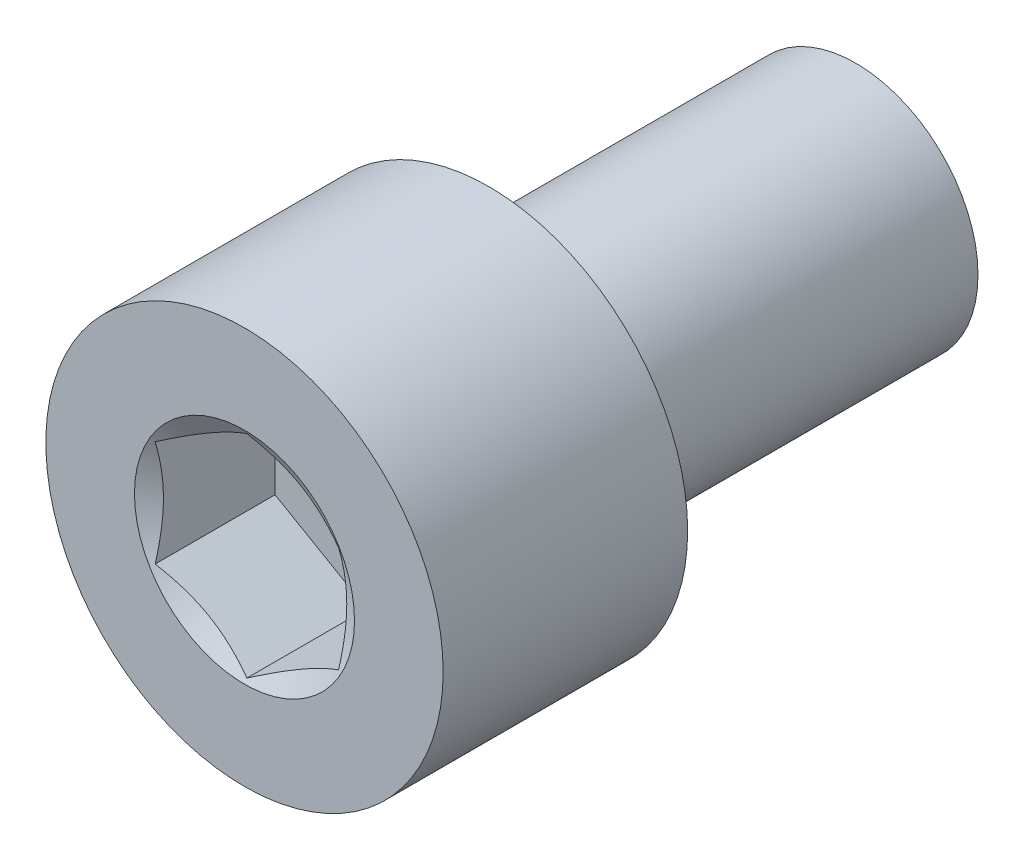
ISO-10303-21;
HEADER;
FILE_DESCRIPTION(('STEP AP214'),'2;1');
FILE_NAME('part.step','',(''),(''),'','','');
FILE_SCHEMA(('AUTOMOTIVE_DESIGN { 1 0 10303 214 1 1 1 1 }'));
ENDSEC;
DATA;
#1=APPLICATION_CONTEXT('core data for automotive mechanical design processes');
#2=APPLICATION_PROTOCOL_DEFINITION('international standard','automotive_design',2000,#1);
#3=PRODUCT_CONTEXT('',#1,'mechanical');
#4=PRODUCT('Part','Part','',(#3));
#5=PRODUCT_RELATED_PRODUCT_CATEGORY('part','',(#4));
#6=PRODUCT_DEFINITION_FORMATION('','',#4);
#7=PRODUCT_DEFINITION_CONTEXT('part definition',#1,'design');
#8=PRODUCT_DEFINITION('design','',#6,#7);
#9=PRODUCT_DEFINITION_SHAPE('','',#8);
#10=(LENGTH_UNIT() NAMED_UNIT(*) SI_UNIT(.MILLI.,.METRE.));
#11=(NAMED_UNIT(*) PLANE_ANGLE_UNIT() SI_UNIT($,.RADIAN.));
#12=(NAMED_UNIT(*) SI_UNIT($,.STERADIAN.) SOLID_ANGLE_UNIT());
#13=UNCERTAINTY_MEASURE_WITH_UNIT(LENGTH_MEASURE(1.E-05),#10,'distance_accuracy_value','');
#14=(GEOMETRIC_REPRESENTATION_CONTEXT(3) GLOBAL_UNCERTAINTY_ASSIGNED_CONTEXT((#13)) GLOBAL_UNIT_ASSIGNED_CONTEXT((#10,
#11,#12)) REPRESENTATION_CONTEXT('',''));
#15=CARTESIAN_POINT('',(0.,0.,0.));
#16=DIRECTION('',(0.,0.,1.));
#17=DIRECTION('',(1.,0.,0.));
#18=AXIS2_PLACEMENT_3D('',#15,#16,#17);
#19=CARTESIAN_POINT('',(0.,0.,0.));
#20=DIRECTION('',(0.,0.,1.));
#21=DIRECTION('',(1.,0.,0.));
#22=AXIS2_PLACEMENT_3D('',#19,#20,#21);
#23=PLANE('',#22);
#24=CARTESIAN_POINT('',(0.,0.,0.));
#25=DIRECTION('',(0.,0.,1.));
#26=DIRECTION('',(1.,0.,0.));
#27=AXIS2_PLACEMENT_3D('',#24,#25,#26);
#28=CIRCLE('',#27,6.5);
#29=CARTESIAN_POINT('',(6.5,0.,0.));
#30=VERTEX_POINT('',#29);
#31=EDGE_CURVE('E119',#30,#30,#28,.T.);
#32=ORIENTED_EDGE('',*,*,#31,.F.);
#33=EDGE_LOOP('',(#32));
#34=FACE_BOUND('',#33,.T.);
#35=CARTESIAN_POINT('',(0.,0.,0.));
#36=DIRECTION('',(0.,0.,1.));
#37=DIRECTION('',(1.,0.,0.));
#38=AXIS2_PLACEMENT_3D('',#35,#36,#37);
#39=CIRCLE('',#38,3.99999999999999);
#40=CARTESIAN_POINT('',(3.99999999999999,0.,0.));
#41=VERTEX_POINT('',#40);
#42=EDGE_CURVE('E46',#41,#41,#39,.F.);
#43=ORIENTED_EDGE('',*,*,#42,.F.);
#44=EDGE_LOOP('',(#43));
#45=FACE_BOUND('',#44,.T.);
#46=ADVANCED_FACE('F33',(#34,#45),#23,.F.);
#47=CARTESIAN_POINT('',(0.,0.,8.));
#48=DIRECTION('',(0.,0.,-1.));
#49=DIRECTION('',(-1.,0.,0.));
#50=AXIS2_PLACEMENT_3D('',#47,#48,#49);
#51=CYLINDRICAL_SURFACE('',#50,6.5);
#52=CARTESIAN_POINT('',(0.,0.,8.));
#53=DIRECTION('',(0.,0.,1.));
#54=DIRECTION('',(1.,0.,0.));
#55=AXIS2_PLACEMENT_3D('',#52,#53,#54);
#56=CIRCLE('',#55,6.5);
#57=CARTESIAN_POINT('',(6.5,0.,8.));
#58=VERTEX_POINT('',#57);
#59=EDGE_CURVE('E120',#58,#58,#56,.T.);
#60=ORIENTED_EDGE('',*,*,#59,.F.);
#61=EDGE_LOOP('',(#60));
#62=FACE_BOUND('',#61,.T.);
#63=ORIENTED_EDGE('',*,*,#31,.T.);
#64=EDGE_LOOP('',(#63));
#65=FACE_BOUND('',#64,.T.);
#66=ADVANCED_FACE('F35',(#62,#65),#51,.T.);
#67=CARTESIAN_POINT('',(0.,0.,8.));
#68=DIRECTION('',(0.,0.,1.));
#69=DIRECTION('',(1.,0.,0.));
#70=AXIS2_PLACEMENT_3D('',#67,#68,#69);
#71=PLANE('',#70);
#72=CARTESIAN_POINT('',(0.,0.,8.));
#73=DIRECTION('',(0.,0.,1.));
#74=DIRECTION('',(1.,0.,0.));
#75=AXIS2_PLACEMENT_3D('',#72,#73,#74);
#76=CIRCLE('',#75,3.6);
#77=CARTESIAN_POINT('',(3.6,0.,8.));
#78=VERTEX_POINT('',#77);
#79=EDGE_CURVE('E228',#78,#78,#76,.T.);
#80=ORIENTED_EDGE('',*,*,#79,.F.);
#81=EDGE_LOOP('',(#80));
#82=FACE_BOUND('',#81,.T.);
#83=ORIENTED_EDGE('',*,*,#59,.T.);
#84=EDGE_LOOP('',(#83));
#85=FACE_BOUND('',#84,.T.);
#86=ADVANCED_FACE('F134',(#82,#85),#71,.T.);
#87=CARTESIAN_POINT('',(0.,0.,1.38579367521123));
#88=DIRECTION('',(0.,0.,1.));
#89=DIRECTION('',(1.,0.,0.));
#90=AXIS2_PLACEMENT_3D('',#87,#88,#89);
#91=CYLINDRICAL_SURFACE('',#90,3.99999999999999);
#92=CARTESIAN_POINT('',(0.,0.,-12.));
#93=DIRECTION('',(0.,0.,1.));
#94=DIRECTION('',(1.,0.,0.));
#95=AXIS2_PLACEMENT_3D('',#92,#93,#94);
#96=CIRCLE('',#95,3.99999999999999);
#97=CARTESIAN_POINT('',(3.99999999999999,0.,-12.));
#98=VERTEX_POINT('',#97);
#99=EDGE_CURVE('E116',#98,#98,#96,.T.);
#100=ORIENTED_EDGE('',*,*,#99,.T.);
#101=EDGE_LOOP('',(#100));
#102=FACE_BOUND('',#101,.T.);
#103=ORIENTED_EDGE('',*,*,#42,.T.);
#104=EDGE_LOOP('',(#103));
#105=FACE_BOUND('',#104,.T.);
#106=ADVANCED_FACE('F127',(#102,#105),#91,.T.);
#107=CARTESIAN_POINT('',(0.,0.,-12.));
#108=DIRECTION('',(0.,0.,1.));
#109=DIRECTION('',(1.,0.,0.));
#110=AXIS2_PLACEMENT_3D('',#107,#108,#109);
#111=PLANE('',#110);
#112=ORIENTED_EDGE('',*,*,#99,.F.);
#113=EDGE_LOOP('',(#112));
#114=FACE_BOUND('',#113,.T.);
#115=ADVANCED_FACE('F141',(#114),#111,.F.);
#116=CARTESIAN_POINT('',(0.,0.,8.));
#117=DIRECTION('',(0.,0.,1.));
#118=DIRECTION('',(1.,0.,0.));
#119=AXIS2_PLACEMENT_3D('',#116,#117,#118);
#120=CONICAL_SURFACE('',#119,3.6,1.0471975511966);
#121=ORIENTED_EDGE('',*,*,#79,.T.);
#122=EDGE_LOOP('',(#121));
#123=FACE_BOUND('',#122,.T.);
#124=CARTESIAN_POINT('',(3.,-4.50898974946003,9.04835789150263));
#125=CARTESIAN_POINT('',(3.,-4.37903809437815,8.98591123820473));
#126=CARTESIAN_POINT('',(3.,-4.2487720738661,8.92410669082968));
#127=CARTESIAN_POINT('',(3.,-3.98744339453178,8.80214639826395));
#128=CARTESIAN_POINT('',(3.,-3.8563805991232,8.74199094609618));
#129=CARTESIAN_POINT('',(3.,-3.59254393501439,8.62335949478199));
#130=CARTESIAN_POINT('',(3.,-3.45976451486916,8.56489579601136));
#131=CARTESIAN_POINT('',(3.,-3.19309725751096,8.45056307683117));
#132=CARTESIAN_POINT('',(3.,-3.05920947792904,8.39469392249994));
#133=CARTESIAN_POINT('',(3.,-2.78649755356323,8.28478375613357));
#134=CARTESIAN_POINT('',(3.,-2.64763727867527,8.23083186776386));
#135=CARTESIAN_POINT('',(3.,-2.36824044859185,8.12737001569005));
#136=CARTESIAN_POINT('',(3.,-2.22770370048158,8.07786056888232));
#137=CARTESIAN_POINT('',(3.,-1.94504299566507,7.98468882286821));
#138=CARTESIAN_POINT('',(3.,-1.8029234308695,7.94101334243221));
#139=CARTESIAN_POINT('',(3.,-1.51665362384105,7.86100362658197));
#140=CARTESIAN_POINT('',(3.,-1.37250408167063,7.82466692355949));
#141=CARTESIAN_POINT('',(3.,-1.08280597738231,7.76133988867214));
#142=CARTESIAN_POINT('',(3.,-0.937266614059739,7.73430828689994));
#143=CARTESIAN_POINT('',(3.,-0.644539950176806,7.69123224243617));
#144=CARTESIAN_POINT('',(3.,-0.497352767694912,7.67518701754633));
#145=CARTESIAN_POINT('',(3.,-0.203920340872733,7.65557319493159));
#146=CARTESIAN_POINT('',(3.,-0.0576852900481475,7.65185578885612));
#147=CARTESIAN_POINT('',(3.,0.234583027677094,7.65682913710041));
#148=CARTESIAN_POINT('',(3.,0.380616282036963,7.66552063067748));
#149=CARTESIAN_POINT('',(3.,0.632947874602745,7.69067130130531));
#150=CARTESIAN_POINT('',(3.,0.739525196673373,7.7044631336494));
#151=CARTESIAN_POINT('',(3.,0.951798190917133,7.73771550118642));
#152=CARTESIAN_POINT('',(3.,1.05749372116326,7.75717693147801));
#153=CARTESIAN_POINT('',(3.,1.37316914905559,7.82303143172446));
#154=CARTESIAN_POINT('',(3.,1.58160565192263,7.87687989531391));
#155=CARTESIAN_POINT('',(3.,1.89327160259636,7.96899955363205));
#156=CARTESIAN_POINT('',(3.,1.99814168475832,8.00202524580029));
#157=CARTESIAN_POINT('',(3.,2.20686176005441,8.07118496411497));
#158=CARTESIAN_POINT('',(3.,2.31071174584632,8.10731901261583));
#159=CARTESIAN_POINT('',(3.,2.51743253506358,8.18214249236626));
#160=CARTESIAN_POINT('',(3.,2.62030370739974,8.22083091339056));
#161=CARTESIAN_POINT('',(3.,2.82521425892783,8.30034027566353));
#162=CARTESIAN_POINT('',(3.,2.92725365226845,8.34116118055044));
#163=CARTESIAN_POINT('',(3.,3.18939644158425,8.44868935536117));
#164=CARTESIAN_POINT('',(3.,3.34895772998077,8.51671657663549));
#165=CARTESIAN_POINT('',(3.,3.66662357627891,8.65610134962233));
#166=CARTESIAN_POINT('',(3.,3.82472801987503,8.72745916003643));
#167=CARTESIAN_POINT('',(3.,4.13979429327004,8.87274826966938));
#168=CARTESIAN_POINT('',(3.,4.29675582981943,8.94668020305149));
#169=CARTESIAN_POINT('',(3.,4.60972357454943,9.09654235660515));
#170=CARTESIAN_POINT('',(3.,4.76572976074468,9.17247262255262));
#171=CARTESIAN_POINT('',(3.,5.23296563982446,9.4027951005764));
#172=CARTESIAN_POINT('',(3.,5.54303366901103,9.55954155966154));
#173=CARTESIAN_POINT('',(3.,6.1610265222709,9.87706499490209));
#174=CARTESIAN_POINT('',(3.,6.46895165884093,10.037841366945));
#175=CARTESIAN_POINT('',(3.,7.05394853100208,10.3466784349075));
#176=CARTESIAN_POINT('',(3.,7.33115475101327,10.4944848018603));
#177=CARTESIAN_POINT('',(3.,7.88467616460146,10.7917832304171));
#178=CARTESIAN_POINT('',(3.,8.16099131827535,10.9412753662004));
#179=CARTESIAN_POINT('',(3.,8.71221478444676,11.2411302733273));
#180=CARTESIAN_POINT('',(3.,8.98712488660679,11.3914897583934));
#181=CARTESIAN_POINT('',(3.,9.53638759945027,11.6931853844746));
#182=CARTESIAN_POINT('',(3.,9.81074024229737,11.8445214669106));
#183=CARTESIAN_POINT('',(3.,10.0848935954569,11.99621539628));
#184=B_SPLINE_CURVE_WITH_KNOTS('',3,(#124,#125,#126,#127,#128,#129,#130,#131,#132,#133,#134,
#135,#136,#137,#138,#139,#140,#141,#142,#143,#144,#145,#146,#147,#148,#149,#150,#151,#152,#153,
#154,#155,#156,#157,#158,#159,#160,#161,#162,#163,#164,#165,#166,#167,#168,#169,#170,#171,#172,
#173,#174,#175,#176,#177,#178,#179,#180,#181,#182,#183),.UNSPECIFIED.,.F.,.F.,(4,2,2,2,2,2,2,2,
2,2,2,2,2,2,2,2,2,2,2,2,2,2,2,2,2,2,2,2,2,4),(0.,0.432537156188413,0.865150676924325,
1.3003703326017,1.73556749867678,2.1824281284207,2.62934068499826,3.07522576459038,
3.52096066818467,3.96469238116992,4.40839249845341,4.84671685765636,5.28506733102145,
5.60730635380341,5.92959627828527,6.5745735368195,6.90439201959958,7.23421287453924,
7.56390406150441,7.89358962861836,8.41390703437011,8.93426492295015,9.45475192728967,
9.97525086484997,11.017503859111,12.0596015358246,13.0020426274196,13.9445253524482,
14.8845507308598,15.8245202384157),.UNSPECIFIED.);
#185=CARTESIAN_POINT('',(3.,-1.73205080756888,7.92153903091735));
#186=VERTEX_POINT('',#185);
#187=CARTESIAN_POINT('',(3.,1.73205080756888,7.92153903091735));
#188=VERTEX_POINT('',#187);
#189=EDGE_CURVE('E100',#186,#188,#184,.T.);
#190=ORIENTED_EDGE('',*,*,#189,.F.);
#191=CARTESIAN_POINT('',(-0.000200000000001022,-3.46421708519159,7.92160570091724));
#192=CARTESIAN_POINT('',(0.131635206588331,-3.38810199317915,7.87764354293853));
#193=CARTESIAN_POINT('',(0.264608405355248,-3.31132988107606,7.83766142477886));
#194=CARTESIAN_POINT('',(0.532857420002055,-3.15645624025988,7.76787191893169));
#195=CARTESIAN_POINT('',(0.668138002634341,-3.078351959461,7.73808922075161));
#196=CARTESIAN_POINT('',(0.937022602096482,-2.92311136358059,7.69172767769748));
#197=CARTESIAN_POINT('',(1.07058524542946,-2.84599893549861,7.67484027960918));
#198=CARTESIAN_POINT('',(1.33833905729569,-2.6914112001411,7.65467948093475));
#199=CARTESIAN_POINT('',(1.47252925247984,-2.61393645482892,7.65138938626731));
#200=CARTESIAN_POINT('',(1.72327559769581,-2.46916798492017,7.65823036937162));
#201=CARTESIAN_POINT('',(1.83986926497267,-2.40185259973206,7.66668175267884));
#202=CARTESIAN_POINT('',(2.07229698497464,-2.2676603930218,7.69346878149326));
#203=CARTESIAN_POINT('',(2.18813023365133,-2.2007840357172,7.71181357934794));
#204=CARTESIAN_POINT('',(2.42103725705637,-2.06631510305815,7.75767458933955));
#205=CARTESIAN_POINT('',(2.53808155051394,-1.99873954872331,7.78538522374931));
#206=CARTESIAN_POINT('',(2.77042435049912,-1.86459637060759,7.84827763362363));
#207=CARTESIAN_POINT('',(2.88572583417111,-1.79802702797161,7.88344462950778));
#208=CARTESIAN_POINT('',(3.0002,-1.73193533751504,7.92160570091724));
#209=B_SPLINE_CURVE_WITH_KNOTS('',3,(#191,#192,#193,#194,#195,#196,#197,#198,#199,#200,#201,
#202,#203,#204,#205,#206,#207,#208),.UNSPECIFIED.,.F.,.F.,(4,2,2,2,2,2,2,2,4),(0.,
0.475539830103041,0.952222784107964,1.41710776961288,1.88142182298026,2.28572436316091,
2.69040156475039,3.10405572063576,3.5168974940707),.UNSPECIFIED.);
#210=CARTESIAN_POINT('',(0.,-3.46410161513775,7.92153903091735));
#211=VERTEX_POINT('',#210);
#212=EDGE_CURVE('E185',#211,#186,#209,.T.);
#213=ORIENTED_EDGE('',*,*,#212,.F.);
#214=CARTESIAN_POINT('',(-3.0002,-1.73193533751504,7.92160570091724));
#215=CARTESIAN_POINT('',(-2.86836479341167,-1.80805042952748,7.87764354293853));
#216=CARTESIAN_POINT('',(-2.73539159464475,-1.88482254163057,7.83766142477886));
#217=CARTESIAN_POINT('',(-2.46714257999795,-2.03969618244675,7.76787191893169));
#218=CARTESIAN_POINT('',(-2.33186199736566,-2.11780046324563,7.73808922075161));
#219=CARTESIAN_POINT('',(-2.06297739790352,-2.27304105912604,7.69172767769748));
#220=CARTESIAN_POINT('',(-1.92941475457054,-2.35015348720802,7.67484027960918));
#221=CARTESIAN_POINT('',(-1.66166094270431,-2.50474122256553,7.65467948093475));
#222=CARTESIAN_POINT('',(-1.52747074752016,-2.58221596787771,7.65138938626731));
#223=CARTESIAN_POINT('',(-1.27672440230419,-2.72698443778646,7.65823036937162));
#224=CARTESIAN_POINT('',(-1.16013073502733,-2.79429982297457,7.66668175267884));
#225=CARTESIAN_POINT('',(-0.927703015025365,-2.92849202968483,7.69346878149326));
#226=CARTESIAN_POINT('',(-0.81186976634867,-2.99536838698943,7.71181357934794));
#227=CARTESIAN_POINT('',(-0.578962742943634,-3.12983731964848,7.75767458933955));
#228=CARTESIAN_POINT('',(-0.461918449486061,-3.19741287398332,7.78538522374931));
#229=CARTESIAN_POINT('',(-0.229575649500877,-3.33155605209904,7.84827763362363));
#230=CARTESIAN_POINT('',(-0.114274165828896,-3.39812539473502,7.88344462950778));
#231=CARTESIAN_POINT('',(0.000199999999998659,-3.46421708519159,7.92160570091724));
#232=B_SPLINE_CURVE_WITH_KNOTS('',3,(#214,#215,#216,#217,#218,#219,#220,#221,#222,#223,#224,
#225,#226,#227,#228,#229,#230,#231),.UNSPECIFIED.,.F.,.F.,(4,2,2,2,2,2,2,2,4),(0.,
0.475539830103041,0.952222784107964,1.41710776961288,1.88142182298026,2.28572436316091,
2.69040156475039,3.10405572063576,3.5168974940707),.UNSPECIFIED.);
#233=CARTESIAN_POINT('',(-3.,-1.73205080756888,7.92153903091735));
#234=VERTEX_POINT('',#233);
#235=EDGE_CURVE('E180',#234,#211,#232,.T.);
#236=ORIENTED_EDGE('',*,*,#235,.F.);
#237=CARTESIAN_POINT('',(-3.,-4.50898974946003,9.04835789150263));
#238=CARTESIAN_POINT('',(-3.,-4.37903809437815,8.98591123820473));
#239=CARTESIAN_POINT('',(-3.,-4.2487720738661,8.92410669082969));
#240=CARTESIAN_POINT('',(-3.,-3.98744339453178,8.80214639826395));
#241=CARTESIAN_POINT('',(-3.,-3.8563805991232,8.74199094609618));
#242=CARTESIAN_POINT('',(-3.,-3.59254393501438,8.62335949478198));
#243=CARTESIAN_POINT('',(-3.,-3.45976451486915,8.56489579601136));
#244=CARTESIAN_POINT('',(-3.,-3.19309725751095,8.45056307683117));
#245=CARTESIAN_POINT('',(-3.,-3.05920947792903,8.39469392249994));
#246=CARTESIAN_POINT('',(-3.,-2.78649755356322,8.28478375613357));
#247=CARTESIAN_POINT('',(-3.,-2.64763727867527,8.23083186776386));
#248=CARTESIAN_POINT('',(-3.,-2.36824044859185,8.12737001569005));
#249=CARTESIAN_POINT('',(-3.,-2.22770370048158,8.07786056888232));
#250=CARTESIAN_POINT('',(-3.,-1.94504299566507,7.98468882286821));
#251=CARTESIAN_POINT('',(-3.,-1.8029234308695,7.94101334243221));
#252=CARTESIAN_POINT('',(-3.,-1.51665362384105,7.86100362658197));
#253=CARTESIAN_POINT('',(-3.,-1.37250408167063,7.8246669235595));
#254=CARTESIAN_POINT('',(-3.,-1.08280597738231,7.76133988867214));
#255=CARTESIAN_POINT('',(-3.,-0.937266614059737,7.73430828689994));
#256=CARTESIAN_POINT('',(-3.,-0.644539950176804,7.69123224243618));
#257=CARTESIAN_POINT('',(-3.,-0.49735276769491,7.67518701754633));
#258=CARTESIAN_POINT('',(-3.,-0.203920340872732,7.65557319493159));
#259=CARTESIAN_POINT('',(-3.,-0.0576852900481456,7.65185578885613));
#260=CARTESIAN_POINT('',(-3.,0.234583027677096,7.65682913710041));
#261=CARTESIAN_POINT('',(-3.,0.380616282036965,7.66552063067749));
#262=CARTESIAN_POINT('',(-3.,0.632947874602748,7.69067130130531));
#263=CARTESIAN_POINT('',(-3.,0.739525196673376,7.70446313364941));
#264=CARTESIAN_POINT('',(-3.,0.951798190917136,7.73771550118643));
#265=CARTESIAN_POINT('',(-3.,1.05749372116326,7.75717693147801));
#266=CARTESIAN_POINT('',(-3.,1.3731691490556,7.82303143172447));
#267=CARTESIAN_POINT('',(-3.,1.58160565192264,7.87687989531392));
#268=CARTESIAN_POINT('',(-3.,1.89327160259637,7.96899955363205));
#269=CARTESIAN_POINT('',(-3.,1.99814168475833,8.00202524580029));
#270=CARTESIAN_POINT('',(-3.,2.20686176005442,8.07118496411497));
#271=CARTESIAN_POINT('',(-3.,2.31071174584632,8.10731901261583));
#272=CARTESIAN_POINT('',(-3.,2.51743253506359,8.18214249236627));
#273=CARTESIAN_POINT('',(-3.,2.62030370739975,8.22083091339056));
#274=CARTESIAN_POINT('',(-3.,2.82521425892784,8.30034027566353));
#275=CARTESIAN_POINT('',(-3.,2.92725365226846,8.34116118055044));
#276=CARTESIAN_POINT('',(-3.,3.18939644158425,8.44868935536118));
#277=CARTESIAN_POINT('',(-3.,3.34895772998077,8.51671657663549));
#278=CARTESIAN_POINT('',(-3.,3.66662357627892,8.65610134962234));
#279=CARTESIAN_POINT('',(-3.,3.82472801987504,8.72745916003643));
#280=CARTESIAN_POINT('',(-3.,4.13979429327005,8.87274826966938));
#281=CARTESIAN_POINT('',(-3.,4.29675582981944,8.94668020305149));
#282=CARTESIAN_POINT('',(-3.,4.60972357454943,9.09654235660515));
#283=CARTESIAN_POINT('',(-3.,4.76572976074469,9.17247262255262));
#284=CARTESIAN_POINT('',(-3.,5.23296563982447,9.4027951005764));
#285=CARTESIAN_POINT('',(-3.,5.54303366901104,9.55954155966155));
#286=CARTESIAN_POINT('',(-3.,6.1610265222709,9.87706499490209));
#287=CARTESIAN_POINT('',(-3.,6.46895165884093,10.037841366945));
#288=CARTESIAN_POINT('',(-3.,7.05394853100208,10.3466784349076));
#289=CARTESIAN_POINT('',(-3.,7.33115475101327,10.4944848018603));
#290=CARTESIAN_POINT('',(-3.,7.88467616460146,10.7917832304171));
#291=CARTESIAN_POINT('',(-3.,8.16099131827535,10.9412753662004));
#292=CARTESIAN_POINT('',(-3.,8.71221478444676,11.2411302733273));
#293=CARTESIAN_POINT('',(-3.,8.98712488660679,11.3914897583934));
#294=CARTESIAN_POINT('',(-3.,9.53638759945027,11.6931853844746));
#295=CARTESIAN_POINT('',(-3.,9.81074024229737,11.8445214669106));
#296=CARTESIAN_POINT('',(-3.,10.0848935954569,11.99621539628));
#297=B_SPLINE_CURVE_WITH_KNOTS('',3,(#237,#238,#239,#240,#241,#242,#243,#244,#245,#246,#247,
#248,#249,#250,#251,#252,#253,#254,#255,#256,#257,#258,#259,#260,#261,#262,#263,#264,#265,#266,
#267,#268,#269,#270,#271,#272,#273,#274,#275,#276,#277,#278,#279,#280,#281,#282,#283,#284,#285,
#286,#287,#288,#289,#290,#291,#292,#293,#294,#295,#296),.UNSPECIFIED.,.F.,.F.,(4,2,2,2,2,2,2,2,
2,2,2,2,2,2,2,2,2,2,2,2,2,2,2,2,2,2,2,2,2,4),(0.,0.432537156188412,0.865150676924325,
1.3003703326017,1.73556749867678,2.1824281284207,2.62934068499826,3.07522576459038,
3.52096066818467,3.96469238116992,4.40839249845341,4.84671685765636,5.28506733102145,
5.60730635380341,5.92959627828527,6.57457353681951,6.90439201959959,7.23421287453925,
7.56390406150441,7.89358962861837,8.41390703437012,8.93426492295015,9.45475192728968,
9.97525086484997,11.017503859111,12.0596015358246,13.0020426274196,13.9445253524482,
14.8845507308598,15.8245202384157),.UNSPECIFIED.);
#298=CARTESIAN_POINT('',(-3.,1.73205080756888,7.92153903091735));
#299=VERTEX_POINT('',#298);
#300=EDGE_CURVE('E53',#299,#234,#297,.F.);
#301=ORIENTED_EDGE('',*,*,#300,.F.);
#302=CARTESIAN_POINT('',(0.000200000000000664,3.46421708519159,7.92160570091724));
#303=CARTESIAN_POINT('',(-0.131635206588331,3.38810199317915,7.87764354293853));
#304=CARTESIAN_POINT('',(-0.264608405355248,3.31132988107607,7.83766142477886));
#305=CARTESIAN_POINT('',(-0.532857420002055,3.15645624025988,7.76787191893169));
#306=CARTESIAN_POINT('',(-0.668138002634341,3.078351959461,7.73808922075161));
#307=CARTESIAN_POINT('',(-0.937022602096482,2.92311136358059,7.69172767769748));
#308=CARTESIAN_POINT('',(-1.07058524542946,2.84599893549862,7.67484027960918));
#309=CARTESIAN_POINT('',(-1.33833905729569,2.6914112001411,7.65467948093475));
#310=CARTESIAN_POINT('',(-1.47252925247984,2.61393645482892,7.65138938626731));
#311=CARTESIAN_POINT('',(-1.72327559769581,2.46916798492017,7.65823036937162));
#312=CARTESIAN_POINT('',(-1.83986926497267,2.40185259973206,7.66668175267884));
#313=CARTESIAN_POINT('',(-2.07229698497464,2.2676603930218,7.69346878149326));
#314=CARTESIAN_POINT('',(-2.18813023365133,2.2007840357172,7.71181357934794));
#315=CARTESIAN_POINT('',(-2.42103725705637,2.06631510305815,7.75767458933955));
#316=CARTESIAN_POINT('',(-2.53808155051394,1.99873954872331,7.78538522374931));
#317=CARTESIAN_POINT('',(-2.77042435049913,1.86459637060759,7.84827763362363));
#318=CARTESIAN_POINT('',(-2.88572583417111,1.79802702797161,7.88344462950778));
#319=CARTESIAN_POINT('',(-3.0002,1.73193533751504,7.92160570091724));
#320=B_SPLINE_CURVE_WITH_KNOTS('',3,(#302,#303,#304,#305,#306,#307,#308,#309,#310,#311,#312,
#313,#314,#315,#316,#317,#318,#319),.UNSPECIFIED.,.F.,.F.,(4,2,2,2,2,2,2,2,4),(0.,
0.47553983010304,0.952222784107964,1.41710776961288,1.88142182298026,2.28572436316091,
2.69040156475039,3.10405572063576,3.5168974940707),.UNSPECIFIED.);
#321=CARTESIAN_POINT('',(0.,3.46410161513776,7.92153903091735));
#322=VERTEX_POINT('',#321);
#323=EDGE_CURVE('E11',#322,#299,#320,.T.);
#324=ORIENTED_EDGE('',*,*,#323,.F.);
#325=CARTESIAN_POINT('',(3.0002,1.73193533751504,7.92160570091724));
#326=CARTESIAN_POINT('',(2.86836479341167,1.80805042952748,7.87764354293853));
#327=CARTESIAN_POINT('',(2.73539159464475,1.88482254163057,7.83766142477886));
#328=CARTESIAN_POINT('',(2.46714257999794,2.03969618244676,7.76787191893169));
#329=CARTESIAN_POINT('',(2.33186199736566,2.11780046324564,7.73808922075161));
#330=CARTESIAN_POINT('',(2.06297739790352,2.27304105912605,7.69172767769748));
#331=CARTESIAN_POINT('',(1.92941475457054,2.35015348720802,7.67484027960918));
#332=CARTESIAN_POINT('',(1.66166094270431,2.50474122256554,7.65467948093475));
#333=CARTESIAN_POINT('',(1.52747074752016,2.58221596787772,7.65138938626731));
#334=CARTESIAN_POINT('',(1.27672440230419,2.72698443778647,7.65823036937162));
#335=CARTESIAN_POINT('',(1.16013073502732,2.79429982297457,7.66668175267884));
#336=CARTESIAN_POINT('',(0.927703015025364,2.92849202968484,7.69346878149326));
#337=CARTESIAN_POINT('',(0.811869766348669,2.99536838698943,7.71181357934794));
#338=CARTESIAN_POINT('',(0.578962742943633,3.12983731964849,7.75767458933956));
#339=CARTESIAN_POINT('',(0.46191844948606,3.19741287398333,7.78538522374931));
#340=CARTESIAN_POINT('',(0.229575649500876,3.33155605209904,7.84827763362363));
#341=CARTESIAN_POINT('',(0.114274165828894,3.39812539473502,7.88344462950778));
#342=CARTESIAN_POINT('',(-0.00019999999999923,3.46421708519159,7.92160570091724));
#343=B_SPLINE_CURVE_WITH_KNOTS('',3,(#325,#326,#327,#328,#329,#330,#331,#332,#333,#334,#335,
#336,#337,#338,#339,#340,#341,#342),.UNSPECIFIED.,.F.,.F.,(4,2,2,2,2,2,2,2,4),(0.,
0.475539830103041,0.952222784107964,1.41710776961288,1.88142182298026,2.28572436316091,
2.69040156475039,3.10405572063576,3.5168974940707),.UNSPECIFIED.);
#344=EDGE_CURVE('E91',#188,#322,#343,.T.);
#345=ORIENTED_EDGE('',*,*,#344,.F.);
#346=EDGE_LOOP('',(#190,#213,#236,#301,#324,#345));
#347=FACE_BOUND('',#346,.T.);
#348=ADVANCED_FACE('F90',(#123,#347),#120,.F.);
#349=CARTESIAN_POINT('',(3.,1.73205080756888,4.));
#350=DIRECTION('',(0.,0.,-1.));
#351=DIRECTION('',(-1.,0.,0.));
#352=AXIS2_PLACEMENT_3D('',#349,#350,#351);
#353=PLANE('',#352);
#354=DIRECTION('',(-0.866025403784439,0.5,0.));
#355=VECTOR('',#354,1.);
#356=CARTESIAN_POINT('',(3.,1.73205080756888,4.));
#357=LINE('',#356,#355);
#358=CARTESIAN_POINT('',(3.,1.73205080756888,4.));
#359=VERTEX_POINT('',#358);
#360=CARTESIAN_POINT('',(0.,3.46410161513776,4.));
#361=VERTEX_POINT('',#360);
#362=EDGE_CURVE('E99',#359,#361,#357,.T.);
#363=ORIENTED_EDGE('',*,*,#362,.T.);
#364=DIRECTION('',(-0.866025403784439,-0.5,0.));
#365=VECTOR('',#364,1.);
#366=CARTESIAN_POINT('',(0.,3.46410161513776,4.));
#367=LINE('',#366,#365);
#368=CARTESIAN_POINT('',(-3.,1.73205080756888,4.));
#369=VERTEX_POINT('',#368);
#370=EDGE_CURVE('E104',#361,#369,#367,.T.);
#371=ORIENTED_EDGE('',*,*,#370,.T.);
#372=DIRECTION('',(0.,-1.,0.));
#373=VECTOR('',#372,1.);
#374=CARTESIAN_POINT('',(-3.,1.73205080756888,4.));
#375=LINE('',#374,#373);
#376=CARTESIAN_POINT('',(-3.,-1.73205080756888,4.));
#377=VERTEX_POINT('',#376);
#378=EDGE_CURVE('E210',#369,#377,#375,.T.);
#379=ORIENTED_EDGE('',*,*,#378,.T.);
#380=DIRECTION('',(0.866025403784439,-0.5,0.));
#381=VECTOR('',#380,1.);
#382=CARTESIAN_POINT('',(-3.,-1.73205080756888,4.));
#383=LINE('',#382,#381);
#384=CARTESIAN_POINT('',(0.,-3.46410161513775,4.));
#385=VERTEX_POINT('',#384);
#386=EDGE_CURVE('E214',#377,#385,#383,.T.);
#387=ORIENTED_EDGE('',*,*,#386,.T.);
#388=DIRECTION('',(0.866025403784439,0.5,0.));
#389=VECTOR('',#388,1.);
#390=CARTESIAN_POINT('',(0.,-3.46410161513775,4.));
#391=LINE('',#390,#389);
#392=CARTESIAN_POINT('',(3.,-1.73205080756888,4.));
#393=VERTEX_POINT('',#392);
#394=EDGE_CURVE('E112',#385,#393,#391,.T.);
#395=ORIENTED_EDGE('',*,*,#394,.T.);
#396=DIRECTION('',(0.,1.,0.));
#397=VECTOR('',#396,1.);
#398=CARTESIAN_POINT('',(3.,-1.73205080756888,4.));
#399=LINE('',#398,#397);
#400=EDGE_CURVE('E107',#393,#359,#399,.T.);
#401=ORIENTED_EDGE('',*,*,#400,.T.);
#402=EDGE_LOOP('',(#363,#371,#379,#387,#395,#401));
#403=FACE_BOUND('',#402,.T.);
#404=ADVANCED_FACE('F167',(#403),#353,.F.);
#405=CARTESIAN_POINT('',(0.,3.46410161513776,4.));
#406=DIRECTION('',(-0.5,0.866025403784439,0.));
#407=DIRECTION('',(-0.866025403784439,-0.5,0.));
#408=AXIS2_PLACEMENT_3D('',#405,#406,#407);
#409=PLANE('',#408);
#410=DIRECTION('',(0.,0.,1.));
#411=VECTOR('',#410,1.);
#412=CARTESIAN_POINT('',(0.,3.46410161513776,4.));
#413=LINE('',#412,#411);
#414=EDGE_CURVE('E97',#361,#322,#413,.T.);
#415=ORIENTED_EDGE('',*,*,#414,.T.);
#416=ORIENTED_EDGE('',*,*,#323,.T.);
#417=DIRECTION('',(0.,0.,1.));
#418=VECTOR('',#417,1.);
#419=CARTESIAN_POINT('',(-3.,1.73205080756888,4.));
#420=LINE('',#419,#418);
#421=EDGE_CURVE('E106',#369,#299,#420,.T.);
#422=ORIENTED_EDGE('',*,*,#421,.F.);
#423=ORIENTED_EDGE('',*,*,#370,.F.);
#424=EDGE_LOOP('',(#415,#416,#422,#423));
#425=FACE_BOUND('',#424,.T.);
#426=ADVANCED_FACE('F102',(#425),#409,.F.);
#427=CARTESIAN_POINT('',(-3.,1.73205080756888,4.));
#428=DIRECTION('',(-1.,0.,0.));
#429=DIRECTION('',(0.,0.,1.));
#430=AXIS2_PLACEMENT_3D('',#427,#428,#429);
#431=PLANE('',#430);
#432=ORIENTED_EDGE('',*,*,#421,.T.);
#433=ORIENTED_EDGE('',*,*,#300,.T.);
#434=DIRECTION('',(0.,0.,1.));
#435=VECTOR('',#434,1.);
#436=CARTESIAN_POINT('',(-3.,-1.73205080756888,4.));
#437=LINE('',#436,#435);
#438=EDGE_CURVE('E109',#377,#234,#437,.T.);
#439=ORIENTED_EDGE('',*,*,#438,.F.);
#440=ORIENTED_EDGE('',*,*,#378,.F.);
#441=EDGE_LOOP('',(#432,#433,#439,#440));
#442=FACE_BOUND('',#441,.T.);
#443=ADVANCED_FACE('F199',(#442),#431,.F.);
#444=CARTESIAN_POINT('',(-3.,-1.73205080756888,4.));
#445=DIRECTION('',(-0.5,-0.866025403784439,0.));
#446=DIRECTION('',(0.866025403784439,-0.5,0.));
#447=AXIS2_PLACEMENT_3D('',#444,#445,#446);
#448=PLANE('',#447);
#449=ORIENTED_EDGE('',*,*,#438,.T.);
#450=ORIENTED_EDGE('',*,*,#235,.T.);
#451=DIRECTION('',(0.,0.,1.));
#452=VECTOR('',#451,1.);
#453=CARTESIAN_POINT('',(0.,-3.46410161513775,4.));
#454=LINE('',#453,#452);
#455=EDGE_CURVE('E224',#385,#211,#454,.T.);
#456=ORIENTED_EDGE('',*,*,#455,.F.);
#457=ORIENTED_EDGE('',*,*,#386,.F.);
#458=EDGE_LOOP('',(#449,#450,#456,#457));
#459=FACE_BOUND('',#458,.T.);
#460=ADVANCED_FACE('F194',(#459),#448,.F.);
#461=CARTESIAN_POINT('',(0.,-3.46410161513775,4.));
#462=DIRECTION('',(0.5,-0.866025403784439,0.));
#463=DIRECTION('',(0.866025403784439,0.5,0.));
#464=AXIS2_PLACEMENT_3D('',#461,#462,#463);
#465=PLANE('',#464);
#466=ORIENTED_EDGE('',*,*,#455,.T.);
#467=ORIENTED_EDGE('',*,*,#212,.T.);
#468=DIRECTION('',(0.,0.,1.));
#469=VECTOR('',#468,1.);
#470=CARTESIAN_POINT('',(3.,-1.73205080756888,4.));
#471=LINE('',#470,#469);
#472=EDGE_CURVE('E221',#393,#186,#471,.T.);
#473=ORIENTED_EDGE('',*,*,#472,.F.);
#474=ORIENTED_EDGE('',*,*,#394,.F.);
#475=EDGE_LOOP('',(#466,#467,#473,#474));
#476=FACE_BOUND('',#475,.T.);
#477=ADVANCED_FACE('F191',(#476),#465,.F.);
#478=CARTESIAN_POINT('',(3.,-1.73205080756888,4.));
#479=DIRECTION('',(1.,0.,0.));
#480=DIRECTION('',(0.,1.,0.));
#481=AXIS2_PLACEMENT_3D('',#478,#479,#480);
#482=PLANE('',#481);
#483=ORIENTED_EDGE('',*,*,#472,.T.);
#484=ORIENTED_EDGE('',*,*,#189,.T.);
#485=DIRECTION('',(0.,0.,1.));
#486=VECTOR('',#485,1.);
#487=CARTESIAN_POINT('',(3.,1.73205080756888,4.));
#488=LINE('',#487,#486);
#489=EDGE_CURVE('E60',#359,#188,#488,.T.);
#490=ORIENTED_EDGE('',*,*,#489,.F.);
#491=ORIENTED_EDGE('',*,*,#400,.F.);
#492=EDGE_LOOP('',(#483,#484,#490,#491));
#493=FACE_BOUND('',#492,.T.);
#494=ADVANCED_FACE('F150',(#493),#482,.F.);
#495=CARTESIAN_POINT('',(3.,1.73205080756888,4.));
#496=DIRECTION('',(0.5,0.866025403784439,0.));
#497=DIRECTION('',(-0.866025403784439,0.5,0.));
#498=AXIS2_PLACEMENT_3D('',#495,#496,#497);
#499=PLANE('',#498);
#500=ORIENTED_EDGE('',*,*,#489,.T.);
#501=ORIENTED_EDGE('',*,*,#344,.T.);
#502=ORIENTED_EDGE('',*,*,#414,.F.);
#503=ORIENTED_EDGE('',*,*,#362,.F.);
#504=EDGE_LOOP('',(#500,#501,#502,#503));
#505=FACE_BOUND('',#504,.T.);
#506=ADVANCED_FACE('F96',(#505),#499,.F.);
#507=CLOSED_SHELL('',(#46,#66,#86,#106,#115,#348,#404,#426,#443,#460,#477,#494,#506));
#508=MANIFOLD_SOLID_BREP('B2',#507);
#509=ADVANCED_BREP_SHAPE_REPRESENTATION('',(#18,#508),#14);
#510=SHAPE_DEFINITION_REPRESENTATION(#9,#509);
ENDSEC;
END-ISO-10303-21;
